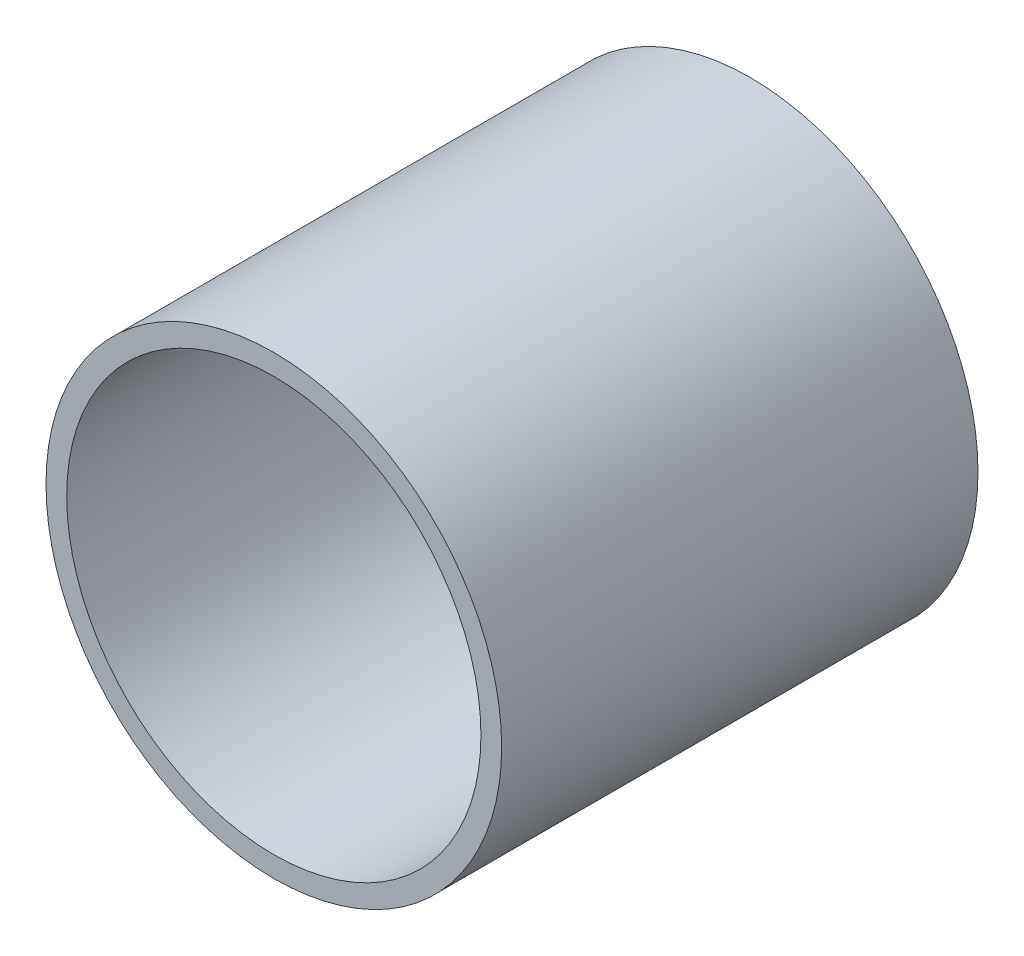
ISO-10303-21;
HEADER;
FILE_DESCRIPTION(('STEP AP214'),'2;1');
FILE_NAME('part.step','',(''),(''),'','','');
FILE_SCHEMA(('AUTOMOTIVE_DESIGN { 1 0 10303 214 1 1 1 1 }'));
ENDSEC;
DATA;
#1=APPLICATION_CONTEXT('core data for automotive mechanical design processes');
#2=APPLICATION_PROTOCOL_DEFINITION('international standard','automotive_design',2000,#1);
#3=PRODUCT_CONTEXT('',#1,'mechanical');
#4=PRODUCT('Part','Part','',(#3));
#5=PRODUCT_RELATED_PRODUCT_CATEGORY('part','',(#4));
#6=PRODUCT_DEFINITION_FORMATION('','',#4);
#7=PRODUCT_DEFINITION_CONTEXT('part definition',#1,'design');
#8=PRODUCT_DEFINITION('design','',#6,#7);
#9=PRODUCT_DEFINITION_SHAPE('','',#8);
#10=(LENGTH_UNIT() NAMED_UNIT(*) SI_UNIT(.MILLI.,.METRE.));
#11=(NAMED_UNIT(*) PLANE_ANGLE_UNIT() SI_UNIT($,.RADIAN.));
#12=(NAMED_UNIT(*) SI_UNIT($,.STERADIAN.) SOLID_ANGLE_UNIT());
#13=UNCERTAINTY_MEASURE_WITH_UNIT(LENGTH_MEASURE(1.E-05),#10,'distance_accuracy_value','');
#14=(GEOMETRIC_REPRESENTATION_CONTEXT(3) GLOBAL_UNCERTAINTY_ASSIGNED_CONTEXT((#13)) GLOBAL_UNIT_ASSIGNED_CONTEXT((#10,
#11,#12)) REPRESENTATION_CONTEXT('',''));
#15=CARTESIAN_POINT('',(0.,0.,0.));
#16=DIRECTION('',(0.,0.,1.));
#17=DIRECTION('',(1.,0.,0.));
#18=AXIS2_PLACEMENT_3D('',#15,#16,#17);
#19=CARTESIAN_POINT('',(0.,0.,23.));
#20=DIRECTION('',(0.,0.,1.));
#21=DIRECTION('',(1.,0.,0.));
#22=AXIS2_PLACEMENT_3D('',#19,#20,#21);
#23=PLANE('',#22);
#24=CARTESIAN_POINT('',(0.,0.,23.));
#25=DIRECTION('',(0.,0.,1.));
#26=DIRECTION('',(1.,0.,0.));
#27=AXIS2_PLACEMENT_3D('',#24,#25,#26);
#28=CIRCLE('',#27,11.);
#29=CARTESIAN_POINT('',(11.,0.,23.));
#30=VERTEX_POINT('',#29);
#31=EDGE_CURVE('E10',#30,#30,#28,.T.);
#32=ORIENTED_EDGE('',*,*,#31,.T.);
#33=EDGE_LOOP('',(#32));
#34=FACE_BOUND('',#33,.T.);
#35=CARTESIAN_POINT('',(0.,0.,23.));
#36=DIRECTION('',(0.,0.,1.));
#37=DIRECTION('',(1.,0.,0.));
#38=AXIS2_PLACEMENT_3D('',#35,#36,#37);
#39=CIRCLE('',#38,10.);
#40=CARTESIAN_POINT('',(10.,0.,23.));
#41=VERTEX_POINT('',#40);
#42=EDGE_CURVE('E54',#41,#41,#39,.T.);
#43=ORIENTED_EDGE('',*,*,#42,.F.);
#44=EDGE_LOOP('',(#43));
#45=FACE_BOUND('',#44,.T.);
#46=ADVANCED_FACE('F41',(#34,#45),#23,.T.);
#47=CARTESIAN_POINT('',(0.,0.,0.));
#48=DIRECTION('',(0.,0.,1.));
#49=DIRECTION('',(1.,0.,0.));
#50=AXIS2_PLACEMENT_3D('',#47,#48,#49);
#51=PLANE('',#50);
#52=CARTESIAN_POINT('',(0.,0.,0.));
#53=DIRECTION('',(0.,0.,1.));
#54=DIRECTION('',(1.,0.,0.));
#55=AXIS2_PLACEMENT_3D('',#52,#53,#54);
#56=CIRCLE('',#55,11.);
#57=CARTESIAN_POINT('',(11.,0.,0.));
#58=VERTEX_POINT('',#57);
#59=EDGE_CURVE('E45',#58,#58,#56,.T.);
#60=ORIENTED_EDGE('',*,*,#59,.F.);
#61=EDGE_LOOP('',(#60));
#62=FACE_BOUND('',#61,.T.);
#63=CARTESIAN_POINT('',(0.,0.,0.));
#64=DIRECTION('',(0.,0.,1.));
#65=DIRECTION('',(1.,0.,0.));
#66=AXIS2_PLACEMENT_3D('',#63,#64,#65);
#67=CIRCLE('',#66,10.);
#68=CARTESIAN_POINT('',(10.,0.,0.));
#69=VERTEX_POINT('',#68);
#70=EDGE_CURVE('E56',#69,#69,#67,.T.);
#71=ORIENTED_EDGE('',*,*,#70,.T.);
#72=EDGE_LOOP('',(#71));
#73=FACE_BOUND('',#72,.T.);
#74=ADVANCED_FACE('F68',(#62,#73),#51,.F.);
#75=CARTESIAN_POINT('',(0.,0.,23.));
#76=DIRECTION('',(0.,0.,-1.));
#77=DIRECTION('',(-1.,0.,0.));
#78=AXIS2_PLACEMENT_3D('',#75,#76,#77);
#79=CYLINDRICAL_SURFACE('',#78,11.);
#80=ORIENTED_EDGE('',*,*,#31,.F.);
#81=EDGE_LOOP('',(#80));
#82=FACE_BOUND('',#81,.T.);
#83=ORIENTED_EDGE('',*,*,#59,.T.);
#84=EDGE_LOOP('',(#83));
#85=FACE_BOUND('',#84,.T.);
#86=ADVANCED_FACE('F43',(#82,#85),#79,.T.);
#87=CARTESIAN_POINT('',(0.,0.,23.));
#88=DIRECTION('',(0.,0.,-1.));
#89=DIRECTION('',(-1.,0.,0.));
#90=AXIS2_PLACEMENT_3D('',#87,#88,#89);
#91=CYLINDRICAL_SURFACE('',#90,10.);
#92=ORIENTED_EDGE('',*,*,#42,.T.);
#93=EDGE_LOOP('',(#92));
#94=FACE_BOUND('',#93,.T.);
#95=ORIENTED_EDGE('',*,*,#70,.F.);
#96=EDGE_LOOP('',(#95));
#97=FACE_BOUND('',#96,.T.);
#98=ADVANCED_FACE('F64',(#94,#97),#91,.F.);
#99=CLOSED_SHELL('',(#46,#74,#86,#98));
#100=MANIFOLD_SOLID_BREP('B2',#99);
#101=ADVANCED_BREP_SHAPE_REPRESENTATION('',(#18,#100),#14);
#102=SHAPE_DEFINITION_REPRESENTATION(#9,#101);
ENDSEC;
END-ISO-10303-21;
